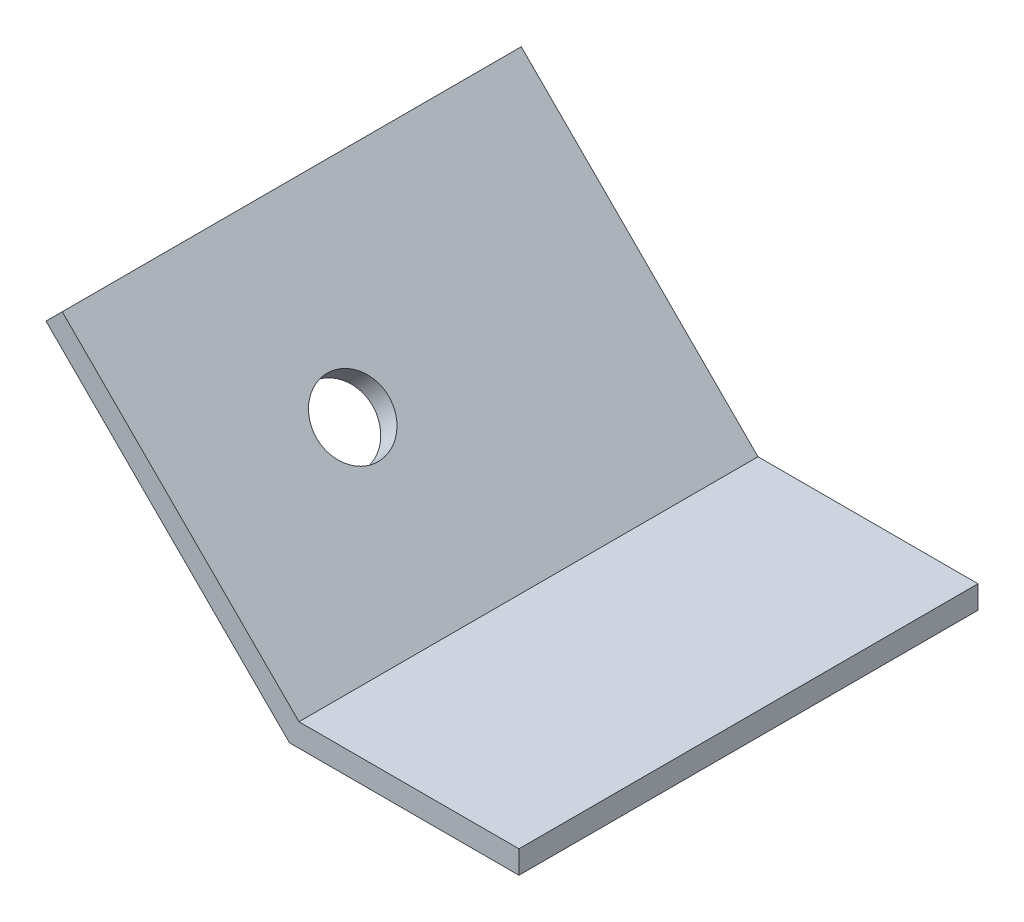
ISO-10303-21;
HEADER;
FILE_DESCRIPTION(('STEP AP214'),'2;1');
FILE_NAME('part.step','',(''),(''),'','','');
FILE_SCHEMA(('AUTOMOTIVE_DESIGN { 1 0 10303 214 1 1 1 1 }'));
ENDSEC;
DATA;
#1=APPLICATION_CONTEXT('core data for automotive mechanical design processes');
#2=APPLICATION_PROTOCOL_DEFINITION('international standard','automotive_design',2000,#1);
#3=PRODUCT_CONTEXT('',#1,'mechanical');
#4=PRODUCT('Part','Part','',(#3));
#5=PRODUCT_RELATED_PRODUCT_CATEGORY('part','',(#4));
#6=PRODUCT_DEFINITION_FORMATION('','',#4);
#7=PRODUCT_DEFINITION_CONTEXT('part definition',#1,'design');
#8=PRODUCT_DEFINITION('design','',#6,#7);
#9=PRODUCT_DEFINITION_SHAPE('','',#8);
#10=(LENGTH_UNIT() NAMED_UNIT(*) SI_UNIT(.MILLI.,.METRE.));
#11=(NAMED_UNIT(*) PLANE_ANGLE_UNIT() SI_UNIT($,.RADIAN.));
#12=(NAMED_UNIT(*) SI_UNIT($,.STERADIAN.) SOLID_ANGLE_UNIT());
#13=UNCERTAINTY_MEASURE_WITH_UNIT(LENGTH_MEASURE(1.E-05),#10,'distance_accuracy_value','');
#14=(GEOMETRIC_REPRESENTATION_CONTEXT(3) GLOBAL_UNCERTAINTY_ASSIGNED_CONTEXT((#13)) GLOBAL_UNIT_ASSIGNED_CONTEXT((#10,
#11,#12)) REPRESENTATION_CONTEXT('',''));
#15=CARTESIAN_POINT('',(0.,0.,0.));
#16=DIRECTION('',(0.,0.,1.));
#17=DIRECTION('',(1.,0.,0.));
#18=AXIS2_PLACEMENT_3D('',#15,#16,#17);
#19=CARTESIAN_POINT('',(0.,0.,50.8));
#20=DIRECTION('',(0.,1.,0.));
#21=DIRECTION('',(0.,0.,1.));
#22=AXIS2_PLACEMENT_3D('',#19,#20,#21);
#23=PLANE('',#22);
#24=DIRECTION('',(1.,0.,0.));
#25=VECTOR('',#24,1.);
#26=CARTESIAN_POINT('',(0.,0.,0.));
#27=LINE('',#26,#25);
#28=CARTESIAN_POINT('',(0.,0.,0.));
#29=VERTEX_POINT('',#28);
#30=CARTESIAN_POINT('',(25.4,0.,0.));
#31=VERTEX_POINT('',#30);
#32=EDGE_CURVE('E113',#29,#31,#27,.T.);
#33=ORIENTED_EDGE('',*,*,#32,.T.);
#34=DIRECTION('',(0.,0.,-1.));
#35=VECTOR('',#34,1.);
#36=CARTESIAN_POINT('',(25.4,0.,50.8));
#37=LINE('',#36,#35);
#38=CARTESIAN_POINT('',(25.4,0.,50.8));
#39=VERTEX_POINT('',#38);
#40=EDGE_CURVE('E11',#39,#31,#37,.T.);
#41=ORIENTED_EDGE('',*,*,#40,.F.);
#42=DIRECTION('',(1.,0.,0.));
#43=VECTOR('',#42,1.);
#44=CARTESIAN_POINT('',(0.,0.,50.8));
#45=LINE('',#44,#43);
#46=CARTESIAN_POINT('',(0.,0.,50.8));
#47=VERTEX_POINT('',#46);
#48=EDGE_CURVE('E78',#47,#39,#45,.T.);
#49=ORIENTED_EDGE('',*,*,#48,.F.);
#50=DIRECTION('',(0.,0.,-1.));
#51=VECTOR('',#50,1.);
#52=CARTESIAN_POINT('',(0.,0.,50.8));
#53=LINE('',#52,#51);
#54=EDGE_CURVE('E109',#47,#29,#53,.T.);
#55=ORIENTED_EDGE('',*,*,#54,.T.);
#56=EDGE_LOOP('',(#33,#41,#49,#55));
#57=FACE_BOUND('',#56,.T.);
#58=ADVANCED_FACE('F32',(#57),#23,.F.);
#59=CARTESIAN_POINT('',(25.4,2.54,50.8));
#60=DIRECTION('',(1.,0.,0.));
#61=DIRECTION('',(0.,0.,-1.));
#62=AXIS2_PLACEMENT_3D('',#59,#60,#61);
#63=PLANE('',#62);
#64=DIRECTION('',(0.,-1.,0.));
#65=VECTOR('',#64,1.);
#66=CARTESIAN_POINT('',(25.4,2.54,0.));
#67=LINE('',#66,#65);
#68=CARTESIAN_POINT('',(25.4,2.54,0.));
#69=VERTEX_POINT('',#68);
#70=EDGE_CURVE('E116',#69,#31,#67,.T.);
#71=ORIENTED_EDGE('',*,*,#70,.F.);
#72=DIRECTION('',(0.,0.,-1.));
#73=VECTOR('',#72,1.);
#74=CARTESIAN_POINT('',(25.4,2.54,50.8));
#75=LINE('',#74,#73);
#76=CARTESIAN_POINT('',(25.4,2.54,50.8));
#77=VERTEX_POINT('',#76);
#78=EDGE_CURVE('E40',#77,#69,#75,.T.);
#79=ORIENTED_EDGE('',*,*,#78,.F.);
#80=DIRECTION('',(0.,-1.,0.));
#81=VECTOR('',#80,1.);
#82=CARTESIAN_POINT('',(25.4,2.54,50.8));
#83=LINE('',#82,#81);
#84=EDGE_CURVE('E174',#77,#39,#83,.T.);
#85=ORIENTED_EDGE('',*,*,#84,.T.);
#86=ORIENTED_EDGE('',*,*,#40,.T.);
#87=EDGE_LOOP('',(#71,#79,#85,#86));
#88=FACE_BOUND('',#87,.T.);
#89=ADVANCED_FACE('F135',(#88),#63,.T.);
#90=CARTESIAN_POINT('',(0.,2.54,50.8));
#91=DIRECTION('',(0.,1.,0.));
#92=DIRECTION('',(0.,0.,1.));
#93=AXIS2_PLACEMENT_3D('',#90,#91,#92);
#94=PLANE('',#93);
#95=DIRECTION('',(1.,0.,0.));
#96=VECTOR('',#95,1.);
#97=CARTESIAN_POINT('',(0.,2.54,0.));
#98=LINE('',#97,#96);
#99=CARTESIAN_POINT('',(1.05210244842766,2.54,0.));
#100=VERTEX_POINT('',#99);
#101=EDGE_CURVE('E120',#100,#69,#98,.T.);
#102=ORIENTED_EDGE('',*,*,#101,.F.);
#103=DIRECTION('',(0.,0.,-1.));
#104=VECTOR('',#103,1.);
#105=CARTESIAN_POINT('',(1.05210244842766,2.54,50.8));
#106=LINE('',#105,#104);
#107=CARTESIAN_POINT('',(1.05210244842766,2.54,50.8));
#108=VERTEX_POINT('',#107);
#109=EDGE_CURVE('E99',#108,#100,#106,.T.);
#110=ORIENTED_EDGE('',*,*,#109,.F.);
#111=DIRECTION('',(1.,0.,0.));
#112=VECTOR('',#111,1.);
#113=CARTESIAN_POINT('',(0.,2.54,50.8));
#114=LINE('',#113,#112);
#115=EDGE_CURVE('E105',#108,#77,#114,.T.);
#116=ORIENTED_EDGE('',*,*,#115,.T.);
#117=ORIENTED_EDGE('',*,*,#78,.T.);
#118=EDGE_LOOP('',(#102,#110,#116,#117));
#119=FACE_BOUND('',#118,.T.);
#120=ADVANCED_FACE('F132',(#119),#94,.T.);
#121=CARTESIAN_POINT('',(-25.1447171389936,28.7368195874213,50.8));
#122=DIRECTION('',(0.707106781186549,0.707106781186546,0.));
#123=DIRECTION('',(-0.707106781186546,0.707106781186549,0.));
#124=AXIS2_PLACEMENT_3D('',#121,#122,#123);
#125=PLANE('',#124);
#126=CARTESIAN_POINT('',(-12.046307345283,15.6384097937107,31.75));
#127=DIRECTION('',(0.707106781186548,0.707106781186547,0.));
#128=DIRECTION('',(-0.707106781186547,0.707106781186548,0.));
#129=AXIS2_PLACEMENT_3D('',#126,#127,#128);
#130=CIRCLE('',#129,4.);
#131=CARTESIAN_POINT('',(-14.8747344700291,18.4668369184569,31.75));
#132=VERTEX_POINT('',#131);
#133=EDGE_CURVE('E167',#132,#132,#130,.T.);
#134=ORIENTED_EDGE('',*,*,#133,.F.);
#135=EDGE_LOOP('',(#134));
#136=FACE_BOUND('',#135,.T.);
#137=DIRECTION('',(0.707106781186546,-0.707106781186549,0.));
#138=VECTOR('',#137,1.);
#139=CARTESIAN_POINT('',(-25.1447171389936,28.7368195874213,0.));
#140=LINE('',#139,#138);
#141=CARTESIAN_POINT('',(-25.1447171389936,28.7368195874213,0.));
#142=VERTEX_POINT('',#141);
#143=EDGE_CURVE('E94',#142,#100,#140,.T.);
#144=ORIENTED_EDGE('',*,*,#143,.F.);
#145=DIRECTION('',(0.,0.,-1.));
#146=VECTOR('',#145,1.);
#147=CARTESIAN_POINT('',(-25.1447171389936,28.7368195874213,50.8));
#148=LINE('',#147,#146);
#149=CARTESIAN_POINT('',(-25.1447171389936,28.7368195874213,50.8));
#150=VERTEX_POINT('',#149);
#151=EDGE_CURVE('E89',#150,#142,#148,.T.);
#152=ORIENTED_EDGE('',*,*,#151,.F.);
#153=DIRECTION('',(0.707106781186546,-0.707106781186549,0.));
#154=VECTOR('',#153,1.);
#155=CARTESIAN_POINT('',(-25.1447171389936,28.7368195874213,50.8));
#156=LINE('',#155,#154);
#157=EDGE_CURVE('E92',#150,#108,#156,.T.);
#158=ORIENTED_EDGE('',*,*,#157,.T.);
#159=ORIENTED_EDGE('',*,*,#109,.T.);
#160=EDGE_LOOP('',(#144,#152,#158,#159));
#161=FACE_BOUND('',#160,.T.);
#162=ADVANCED_FACE('F91',(#136,#161),#125,.T.);
#163=CARTESIAN_POINT('',(-26.9407683632074,26.9407683632075,50.8));
#164=DIRECTION('',(-0.707106781186546,0.707106781186549,0.));
#165=DIRECTION('',(-0.707106781186549,-0.707106781186546,0.));
#166=AXIS2_PLACEMENT_3D('',#163,#164,#165);
#167=PLANE('',#166);
#168=DIRECTION('',(0.707106781186549,0.707106781186546,0.));
#169=VECTOR('',#168,1.);
#170=CARTESIAN_POINT('',(-26.9407683632074,26.9407683632075,0.));
#171=LINE('',#170,#169);
#172=CARTESIAN_POINT('',(-26.9407683632074,26.9407683632075,0.));
#173=VERTEX_POINT('',#172);
#174=EDGE_CURVE('E124',#173,#142,#171,.T.);
#175=ORIENTED_EDGE('',*,*,#174,.F.);
#176=DIRECTION('',(0.,0.,-1.));
#177=VECTOR('',#176,1.);
#178=CARTESIAN_POINT('',(-26.9407683632074,26.9407683632075,50.8));
#179=LINE('',#178,#177);
#180=CARTESIAN_POINT('',(-26.9407683632074,26.9407683632075,50.8));
#181=VERTEX_POINT('',#180);
#182=EDGE_CURVE('E69',#181,#173,#179,.T.);
#183=ORIENTED_EDGE('',*,*,#182,.F.);
#184=DIRECTION('',(0.707106781186549,0.707106781186546,0.));
#185=VECTOR('',#184,1.);
#186=CARTESIAN_POINT('',(-26.9407683632074,26.9407683632075,50.8));
#187=LINE('',#186,#185);
#188=EDGE_CURVE('E103',#181,#150,#187,.T.);
#189=ORIENTED_EDGE('',*,*,#188,.T.);
#190=ORIENTED_EDGE('',*,*,#151,.T.);
#191=EDGE_LOOP('',(#175,#183,#189,#190));
#192=FACE_BOUND('',#191,.T.);
#193=ADVANCED_FACE('F107',(#192),#167,.T.);
#194=CARTESIAN_POINT('',(-26.9407683632074,26.9407683632075,50.8));
#195=DIRECTION('',(0.707106781186549,0.707106781186546,0.));
#196=DIRECTION('',(-0.707106781186546,0.707106781186549,0.));
#197=AXIS2_PLACEMENT_3D('',#194,#195,#196);
#198=PLANE('',#197);
#199=CARTESIAN_POINT('',(-13.8423585694968,13.8423585694968,31.75));
#200=DIRECTION('',(0.707106781186549,0.707106781186546,0.));
#201=DIRECTION('',(-0.707106781186546,0.707106781186549,0.));
#202=AXIS2_PLACEMENT_3D('',#199,#200,#201);
#203=CIRCLE('',#202,4.);
#204=CARTESIAN_POINT('',(-16.670785694243,16.670785694243,31.75));
#205=VERTEX_POINT('',#204);
#206=EDGE_CURVE('E117',#205,#205,#203,.F.);
#207=ORIENTED_EDGE('',*,*,#206,.F.);
#208=EDGE_LOOP('',(#207));
#209=FACE_BOUND('',#208,.T.);
#210=DIRECTION('',(0.707106781186546,-0.707106781186549,0.));
#211=VECTOR('',#210,1.);
#212=CARTESIAN_POINT('',(-26.9407683632074,26.9407683632075,0.));
#213=LINE('',#212,#211);
#214=EDGE_CURVE('E72',#173,#29,#213,.T.);
#215=ORIENTED_EDGE('',*,*,#214,.T.);
#216=ORIENTED_EDGE('',*,*,#54,.F.);
#217=DIRECTION('',(0.707106781186546,-0.707106781186549,0.));
#218=VECTOR('',#217,1.);
#219=CARTESIAN_POINT('',(-26.9407683632074,26.9407683632075,50.8));
#220=LINE('',#219,#218);
#221=EDGE_CURVE('E48',#181,#47,#220,.T.);
#222=ORIENTED_EDGE('',*,*,#221,.F.);
#223=ORIENTED_EDGE('',*,*,#182,.T.);
#224=EDGE_LOOP('',(#215,#216,#222,#223));
#225=FACE_BOUND('',#224,.T.);
#226=ADVANCED_FACE('F140',(#209,#225),#198,.F.);
#227=CARTESIAN_POINT('',(0.,0.,50.8));
#228=DIRECTION('',(0.,0.,-1.));
#229=DIRECTION('',(-1.,0.,0.));
#230=AXIS2_PLACEMENT_3D('',#227,#228,#229);
#231=PLANE('',#230);
#232=ORIENTED_EDGE('',*,*,#48,.T.);
#233=ORIENTED_EDGE('',*,*,#84,.F.);
#234=ORIENTED_EDGE('',*,*,#115,.F.);
#235=ORIENTED_EDGE('',*,*,#157,.F.);
#236=ORIENTED_EDGE('',*,*,#188,.F.);
#237=ORIENTED_EDGE('',*,*,#221,.T.);
#238=EDGE_LOOP('',(#232,#233,#234,#235,#236,#237));
#239=FACE_BOUND('',#238,.T.);
#240=ADVANCED_FACE('F102',(#239),#231,.F.);
#241=CARTESIAN_POINT('',(0.,0.,0.));
#242=DIRECTION('',(0.,0.,-1.));
#243=DIRECTION('',(-1.,0.,0.));
#244=AXIS2_PLACEMENT_3D('',#241,#242,#243);
#245=PLANE('',#244);
#246=ORIENTED_EDGE('',*,*,#32,.F.);
#247=ORIENTED_EDGE('',*,*,#214,.F.);
#248=ORIENTED_EDGE('',*,*,#174,.T.);
#249=ORIENTED_EDGE('',*,*,#143,.T.);
#250=ORIENTED_EDGE('',*,*,#101,.T.);
#251=ORIENTED_EDGE('',*,*,#70,.T.);
#252=EDGE_LOOP('',(#246,#247,#248,#249,#250,#251));
#253=FACE_BOUND('',#252,.T.);
#254=ADVANCED_FACE('F138',(#253),#245,.T.);
#255=CARTESIAN_POINT('',(-27.3137427511005,0.370974387893122,31.75));
#256=DIRECTION('',(0.707106781186548,0.707106781186547,0.));
#257=DIRECTION('',(-0.707106781186547,0.707106781186548,0.));
#258=AXIS2_PLACEMENT_3D('',#255,#256,#257);
#259=CYLINDRICAL_SURFACE('',#258,4.);
#260=ORIENTED_EDGE('',*,*,#133,.T.);
#261=EDGE_LOOP('',(#260));
#262=FACE_BOUND('',#261,.T.);
#263=ORIENTED_EDGE('',*,*,#206,.T.);
#264=EDGE_LOOP('',(#263));
#265=FACE_BOUND('',#264,.T.);
#266=ADVANCED_FACE('F176',(#262,#265),#259,.F.);
#267=CLOSED_SHELL('',(#58,#89,#120,#162,#193,#226,#240,#254,#266));
#268=MANIFOLD_SOLID_BREP('B2',#267);
#269=ADVANCED_BREP_SHAPE_REPRESENTATION('',(#18,#268),#14);
#270=SHAPE_DEFINITION_REPRESENTATION(#9,#269);
ENDSEC;
END-ISO-10303-21;
